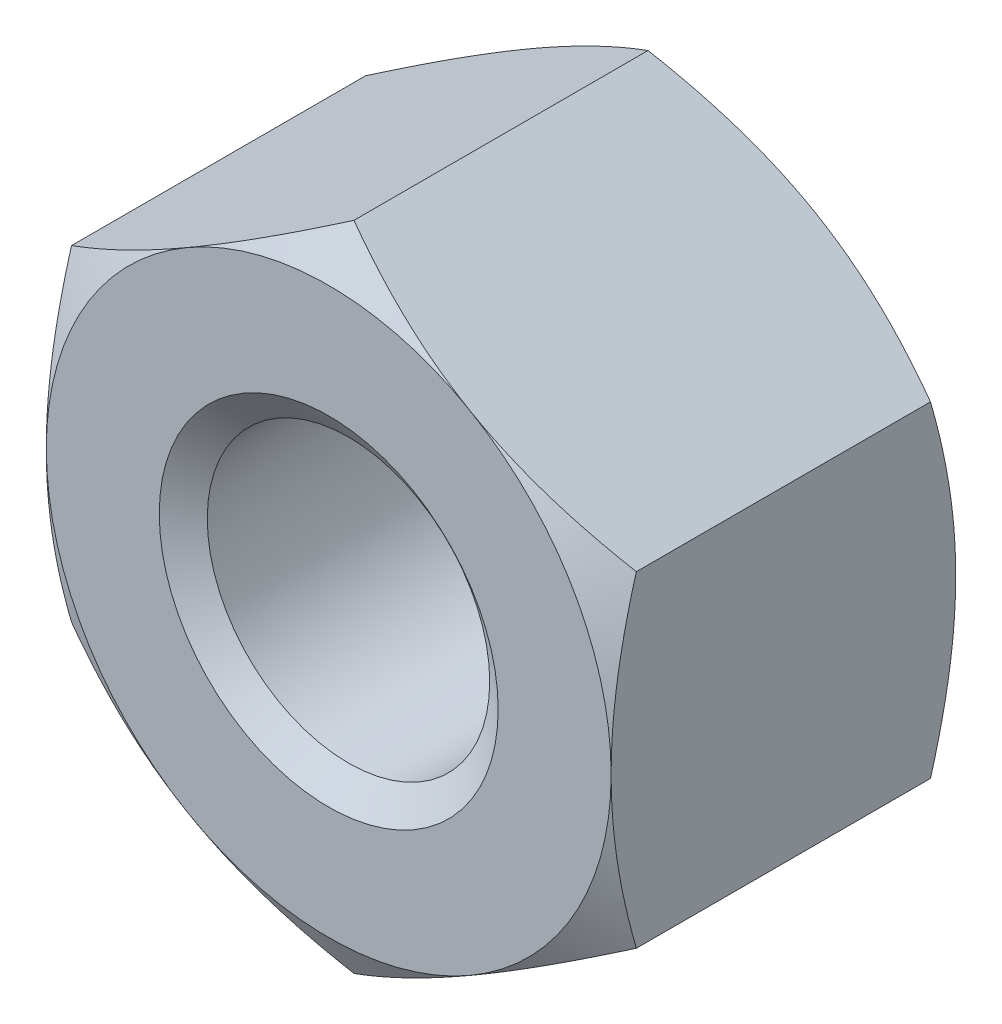
ISO-10303-21;
HEADER;
FILE_DESCRIPTION(('STEP AP214'),'2;1');
FILE_NAME('part.step','',(''),(''),'','','');
FILE_SCHEMA(('AUTOMOTIVE_DESIGN { 1 0 10303 214 1 1 1 1 }'));
ENDSEC;
DATA;
#1=APPLICATION_CONTEXT('core data for automotive mechanical design processes');
#2=APPLICATION_PROTOCOL_DEFINITION('international standard','automotive_design',2000,#1);
#3=PRODUCT_CONTEXT('',#1,'mechanical');
#4=PRODUCT('Part','Part','',(#3));
#5=PRODUCT_RELATED_PRODUCT_CATEGORY('part','',(#4));
#6=PRODUCT_DEFINITION_FORMATION('','',#4);
#7=PRODUCT_DEFINITION_CONTEXT('part definition',#1,'design');
#8=PRODUCT_DEFINITION('design','',#6,#7);
#9=PRODUCT_DEFINITION_SHAPE('','',#8);
#10=(LENGTH_UNIT() NAMED_UNIT(*) SI_UNIT(.MILLI.,.METRE.));
#11=(NAMED_UNIT(*) PLANE_ANGLE_UNIT() SI_UNIT($,.RADIAN.));
#12=(NAMED_UNIT(*) SI_UNIT($,.STERADIAN.) SOLID_ANGLE_UNIT());
#13=UNCERTAINTY_MEASURE_WITH_UNIT(LENGTH_MEASURE(1.E-05),#10,'distance_accuracy_value','');
#14=(GEOMETRIC_REPRESENTATION_CONTEXT(3) GLOBAL_UNCERTAINTY_ASSIGNED_CONTEXT((#13)) GLOBAL_UNIT_ASSIGNED_CONTEXT((#10,
#11,#12)) REPRESENTATION_CONTEXT('',''));
#15=CARTESIAN_POINT('',(0.,0.,0.));
#16=DIRECTION('',(0.,0.,1.));
#17=DIRECTION('',(1.,0.,0.));
#18=AXIS2_PLACEMENT_3D('',#15,#16,#17);
#19=CARTESIAN_POINT('',(0.,0.,-6.1));
#20=DIRECTION('',(0.,0.,1.));
#21=DIRECTION('',(1.,0.,0.));
#22=AXIS2_PLACEMENT_3D('',#19,#20,#21);
#23=CYLINDRICAL_SURFACE('',#22,2.5);
#24=CARTESIAN_POINT('',(0.,0.,-0.350103769104851));
#25=DIRECTION('',(0.,0.,1.));
#26=DIRECTION('',(1.,0.,0.));
#27=AXIS2_PLACEMENT_3D('',#24,#25,#26);
#28=CIRCLE('',#27,2.5);
#29=CARTESIAN_POINT('',(2.5,0.,-0.350103769104851));
#30=VERTEX_POINT('',#29);
#31=EDGE_CURVE('E175',#30,#30,#28,.F.);
#32=ORIENTED_EDGE('',*,*,#31,.F.);
#33=EDGE_LOOP('',(#32));
#34=FACE_BOUND('',#33,.T.);
#35=CARTESIAN_POINT('',(0.,0.,-5.72449623089514));
#36=DIRECTION('',(0.,0.,-1.));
#37=DIRECTION('',(-1.,0.,0.));
#38=AXIS2_PLACEMENT_3D('',#35,#36,#37);
#39=CIRCLE('',#38,2.5);
#40=CARTESIAN_POINT('',(-2.5,0.,-5.72449623089514));
#41=VERTEX_POINT('',#40);
#42=EDGE_CURVE('E40',#41,#41,#39,.F.);
#43=ORIENTED_EDGE('',*,*,#42,.F.);
#44=EDGE_LOOP('',(#43));
#45=FACE_BOUND('',#44,.T.);
#46=ADVANCED_FACE('F35',(#34,#45),#23,.F.);
#47=CARTESIAN_POINT('',(0.,5.77350269189627,-6.1));
#48=DIRECTION('',(-0.500000000000002,0.866025403784437,0.));
#49=DIRECTION('',(-0.866025403784438,-0.500000000000002,0.));
#50=AXIS2_PLACEMENT_3D('',#47,#48,#49);
#51=PLANE('',#50);
#52=DIRECTION('',(0.,0.,1.));
#53=VECTOR('',#52,1.);
#54=CARTESIAN_POINT('',(-5.,2.88675134594812,-6.1));
#55=LINE('',#54,#53);
#56=CARTESIAN_POINT('',(-5.,2.88675134594815,-5.65341801261478));
#57=VERTEX_POINT('',#56);
#58=CARTESIAN_POINT('',(-5.,2.88675134594812,-0.446581987385205));
#59=VERTEX_POINT('',#58);
#60=EDGE_CURVE('E165',#57,#59,#55,.T.);
#61=ORIENTED_EDGE('',*,*,#60,.T.);
#62=CARTESIAN_POINT('',(-5.0002,2.88663587589428,-0.446648656051831));
#63=CARTESIAN_POINT('',(-4.78046540547482,3.01349970319367,-0.373386567637637));
#64=CARTESIAN_POINT('',(-4.55885141554042,3.14144859993848,-0.306751321918093));
#65=CARTESIAN_POINT('',(-4.11178600454649,3.3995619353212,-0.19043899101081));
#66=CARTESIAN_POINT('',(-3.88632664040923,3.52973095989717,-0.140803049915788));
#67=CARTESIAN_POINT('',(-3.43816769477649,3.78847564779797,-0.0635510254186968));
#68=CARTESIAN_POINT('',(-3.21553790689581,3.91701101576052,-0.0354203782834884));
#69=CARTESIAN_POINT('',(-2.88081009815336,4.11026620624322,-0.0101949219536836));
#70=CARTESIAN_POINT('',(-2.76915780319494,4.17472868879311,-0.00461345976948308));
#71=CARTESIAN_POINT('',(-2.5457500293262,4.30371322717528,0.000797783248530206));
#72=CARTESIAN_POINT('',(-2.43399455370969,4.36823528110589,0.00062774174179659));
#73=CARTESIAN_POINT('',(-2.12781576914936,4.54500768479194,-0.00775363179203757));
#74=CARTESIAN_POINT('',(-1.93349391403279,4.65719946015293,-0.021829771897253));
#75=CARTESIAN_POINT('',(-1.54613989800229,4.88083840557982,-0.0664652571094334));
#76=CARTESIAN_POINT('',(-1.35310909862843,4.99228478956021,-0.0970398601475112));
#77=CARTESIAN_POINT('',(-0.964974657525142,5.21637431361295,-0.173468493621169));
#78=CARTESIAN_POINT('',(-0.76992000135826,5.32898917185759,-0.219646378878686));
#79=CARTESIAN_POINT('',(-0.382719654641226,5.55253939626499,-0.324451794491943));
#80=CARTESIAN_POINT('',(-0.190569004591907,5.66347762579593,-0.383054703437384));
#81=CARTESIAN_POINT('',(0.000200000000006643,5.77361816195011,-0.44664865605184));
#82=B_SPLINE_CURVE_WITH_KNOTS('',3,(#62,#63,#64,#65,#66,#67,#68,#69,#70,#71,#72,#73,#74,#75,#76,
#77,#78,#79,#80,#81),.UNSPECIFIED.,.F.,.F.,(4,2,2,2,2,2,2,2,2,4),(0.,0.792555841363092,
1.58701660053334,2.36181537487281,2.74884076077326,3.13585419177295,3.8096236259968,
4.4840172390119,5.1733688234893,5.86136694793727),.UNSPECIFIED.);
#83=CARTESIAN_POINT('',(-2.50000000000001,4.33012701892219,0.));
#84=VERTEX_POINT('',#83);
#85=EDGE_CURVE('E134',#59,#84,#82,.T.);
#86=ORIENTED_EDGE('',*,*,#85,.T.);
#87=CARTESIAN_POINT('',(0.,5.77350269189627,-0.446581987385213));
#88=VERTEX_POINT('',#87);
#89=EDGE_CURVE('E54',#84,#88,#82,.T.);
#90=ORIENTED_EDGE('',*,*,#89,.T.);
#91=DIRECTION('',(0.,0.,1.));
#92=VECTOR('',#91,1.);
#93=CARTESIAN_POINT('',(0.,5.77350269189627,-6.1));
#94=LINE('',#93,#92);
#95=CARTESIAN_POINT('',(0.,5.77350269189627,-5.65341801261478));
#96=VERTEX_POINT('',#95);
#97=EDGE_CURVE('E150',#96,#88,#94,.T.);
#98=ORIENTED_EDGE('',*,*,#97,.F.);
#99=CARTESIAN_POINT('',(-5.0002,2.88663587589428,-5.65335134394817));
#100=CARTESIAN_POINT('',(-4.78046540547482,3.01349970319367,-5.72661343236236));
#101=CARTESIAN_POINT('',(-4.55885141554042,3.14144859993848,-5.7932486780819));
#102=CARTESIAN_POINT('',(-4.11178600454649,3.3995619353212,-5.90956100898919));
#103=CARTESIAN_POINT('',(-3.88632664040923,3.52973095989717,-5.95919695008421));
#104=CARTESIAN_POINT('',(-3.43816769477649,3.78847564779797,-6.0364489745813));
#105=CARTESIAN_POINT('',(-3.21553790689581,3.91701101576052,-6.06457962171651));
#106=CARTESIAN_POINT('',(-2.88081009815336,4.11026620624322,-6.08980507804631));
#107=CARTESIAN_POINT('',(-2.76915780319494,4.17472868879311,-6.09538654023051));
#108=CARTESIAN_POINT('',(-2.5457500293262,4.30371322717528,-6.10079778324853));
#109=CARTESIAN_POINT('',(-2.43399455370969,4.36823528110589,-6.10062774174179));
#110=CARTESIAN_POINT('',(-2.12781576914936,4.54500768479194,-6.09224636820796));
#111=CARTESIAN_POINT('',(-1.93349391403279,4.65719946015293,-6.07817022810274));
#112=CARTESIAN_POINT('',(-1.54613989800229,4.88083840557982,-6.03353474289056));
#113=CARTESIAN_POINT('',(-1.35310909862843,4.99228478956021,-6.00296013985249));
#114=CARTESIAN_POINT('',(-0.964974657525142,5.21637431361295,-5.92653150637883));
#115=CARTESIAN_POINT('',(-0.76992000135826,5.32898917185759,-5.88035362112131));
#116=CARTESIAN_POINT('',(-0.382719654641226,5.55253939626499,-5.77554820550806));
#117=CARTESIAN_POINT('',(-0.190569004591907,5.66347762579593,-5.71694529656261));
#118=CARTESIAN_POINT('',(0.000200000000006649,5.77361816195011,-5.65335134394816));
#119=B_SPLINE_CURVE_WITH_KNOTS('',3,(#99,#100,#101,#102,#103,#104,#105,#106,#107,#108,#109,#110,
#111,#112,#113,#114,#115,#116,#117,#118),.UNSPECIFIED.,.F.,.F.,(4,2,2,2,2,2,2,2,2,4),(0.,
0.792555841363093,1.58701660053334,2.36181537487281,2.74884076077326,3.13585419177295,
3.8096236259968,4.4840172390119,5.1733688234893,5.86136694793727),.UNSPECIFIED.);
#120=CARTESIAN_POINT('',(-2.50000000000001,4.33012701892219,-6.1));
#121=VERTEX_POINT('',#120);
#122=EDGE_CURVE('E168',#121,#96,#119,.T.);
#123=ORIENTED_EDGE('',*,*,#122,.F.);
#124=EDGE_CURVE('E267',#57,#121,#119,.T.);
#125=ORIENTED_EDGE('',*,*,#124,.F.);
#126=EDGE_LOOP('',(#61,#86,#90,#98,#123,#125));
#127=FACE_BOUND('',#126,.T.);
#128=ADVANCED_FACE('F37',(#127),#51,.T.);
#129=CARTESIAN_POINT('',(5.,2.88675134594812,-6.1));
#130=DIRECTION('',(0.500000000000003,0.866025403784437,0.));
#131=DIRECTION('',(-0.866025403784437,0.500000000000003,0.));
#132=AXIS2_PLACEMENT_3D('',#129,#130,#131);
#133=PLANE('',#132);
#134=ORIENTED_EDGE('',*,*,#97,.T.);
#135=CARTESIAN_POINT('',(-0.000199999999993257,5.77361816195011,-0.44664865605184));
#136=CARTESIAN_POINT('',(0.219534594525191,5.64675433465072,-0.373386567637644));
#137=CARTESIAN_POINT('',(0.441148584459587,5.5188054379059,-0.3067513219181));
#138=CARTESIAN_POINT('',(0.888213995453521,5.26069210252318,-0.190438991010816));
#139=CARTESIAN_POINT('',(1.11367335959078,5.13052307794721,-0.140803049915793));
#140=CARTESIAN_POINT('',(1.56183230522352,4.87177839004641,-0.0635510254187007));
#141=CARTESIAN_POINT('',(1.7844620931042,4.74324302208387,-0.0354203782834916));
#142=CARTESIAN_POINT('',(2.11918990184665,4.54998783160116,-0.010194921953686));
#143=CARTESIAN_POINT('',(2.23084219680507,4.48552534905128,-0.00461345976948519));
#144=CARTESIAN_POINT('',(2.45424997067381,4.35654081066911,0.000797783248529064));
#145=CARTESIAN_POINT('',(2.56600544629032,4.2920187567385,0.000627741741796142));
#146=CARTESIAN_POINT('',(2.87218423085065,4.11524635305244,-0.00775363179203673));
#147=CARTESIAN_POINT('',(3.06650608596722,4.00305457769146,-0.0218297718972519));
#148=CARTESIAN_POINT('',(3.45386010199771,3.77941563226457,-0.0664652571094315));
#149=CARTESIAN_POINT('',(3.64689090137158,3.66796924828418,-0.0970398601475088));
#150=CARTESIAN_POINT('',(4.03502534247486,3.44387972423143,-0.173468493621165));
#151=CARTESIAN_POINT('',(4.23007999864174,3.33126486598679,-0.219646378878681));
#152=CARTESIAN_POINT('',(4.61728034535877,3.10771464157939,-0.324451794491936));
#153=CARTESIAN_POINT('',(4.80943099540809,2.99677641204846,-0.383054703437376));
#154=CARTESIAN_POINT('',(5.0002,2.88663587589428,-0.446648656051831));
#155=B_SPLINE_CURVE_WITH_KNOTS('',3,(#135,#136,#137,#138,#139,#140,#141,#142,#143,#144,#145,
#146,#147,#148,#149,#150,#151,#152,#153,#154),.UNSPECIFIED.,.F.,.F.,(4,2,2,2,2,2,2,2,2,4),(0.,
0.792555841363094,1.58701660053334,2.36181537487282,2.74884076077326,3.13585419177296,
3.8096236259968,4.4840172390119,5.1733688234893,5.86136694793726),.UNSPECIFIED.);
#156=CARTESIAN_POINT('',(2.50000000000002,4.33012701892218,0.));
#157=VERTEX_POINT('',#156);
#158=EDGE_CURVE('E144',#88,#157,#155,.T.);
#159=ORIENTED_EDGE('',*,*,#158,.T.);
#160=CARTESIAN_POINT('',(5.,2.88675134594814,-0.446581987385213));
#161=VERTEX_POINT('',#160);
#162=EDGE_CURVE('E61',#157,#161,#155,.T.);
#163=ORIENTED_EDGE('',*,*,#162,.T.);
#164=DIRECTION('',(0.,0.,1.));
#165=VECTOR('',#164,1.);
#166=CARTESIAN_POINT('',(5.,2.88675134594812,-6.1));
#167=LINE('',#166,#165);
#168=CARTESIAN_POINT('',(5.,2.88675134594814,-5.65341801261478));
#169=VERTEX_POINT('',#168);
#170=EDGE_CURVE('E143',#169,#161,#167,.T.);
#171=ORIENTED_EDGE('',*,*,#170,.F.);
#172=CARTESIAN_POINT('',(-0.000199999999993257,5.77361816195011,-5.65335134394816));
#173=CARTESIAN_POINT('',(0.219534594525192,5.64675433465072,-5.72661343236235));
#174=CARTESIAN_POINT('',(0.441148584459588,5.5188054379059,-5.7932486780819));
#175=CARTESIAN_POINT('',(0.888213995453521,5.26069210252318,-5.90956100898918));
#176=CARTESIAN_POINT('',(1.11367335959078,5.13052307794721,-5.9591969500842));
#177=CARTESIAN_POINT('',(1.56183230522352,4.87177839004641,-6.0364489745813));
#178=CARTESIAN_POINT('',(1.7844620931042,4.74324302208387,-6.06457962171651));
#179=CARTESIAN_POINT('',(2.11918990184665,4.54998783160116,-6.08980507804631));
#180=CARTESIAN_POINT('',(2.23084219680507,4.48552534905128,-6.09538654023051));
#181=CARTESIAN_POINT('',(2.45424997067381,4.35654081066911,-6.10079778324853));
#182=CARTESIAN_POINT('',(2.56600544629032,4.2920187567385,-6.10062774174179));
#183=CARTESIAN_POINT('',(2.87218423085065,4.11524635305244,-6.09224636820796));
#184=CARTESIAN_POINT('',(3.06650608596722,4.00305457769146,-6.07817022810275));
#185=CARTESIAN_POINT('',(3.45386010199771,3.77941563226457,-6.03353474289057));
#186=CARTESIAN_POINT('',(3.64689090137158,3.66796924828418,-6.00296013985249));
#187=CARTESIAN_POINT('',(4.03502534247486,3.44387972423143,-5.92653150637883));
#188=CARTESIAN_POINT('',(4.23007999864174,3.33126486598679,-5.88035362112132));
#189=CARTESIAN_POINT('',(4.61728034535877,3.10771464157939,-5.77554820550806));
#190=CARTESIAN_POINT('',(4.80943099540809,2.99677641204846,-5.71694529656262));
#191=CARTESIAN_POINT('',(5.0002,2.88663587589428,-5.65335134394817));
#192=B_SPLINE_CURVE_WITH_KNOTS('',3,(#172,#173,#174,#175,#176,#177,#178,#179,#180,#181,#182,
#183,#184,#185,#186,#187,#188,#189,#190,#191),.UNSPECIFIED.,.F.,.F.,(4,2,2,2,2,2,2,2,2,4),(0.,
0.792555841363094,1.58701660053334,2.36181537487281,2.74884076077326,3.13585419177296,
3.8096236259968,4.4840172390119,5.1733688234893,5.86136694793726),.UNSPECIFIED.);
#193=CARTESIAN_POINT('',(2.50000000000002,4.33012701892218,-6.1));
#194=VERTEX_POINT('',#193);
#195=EDGE_CURVE('E260',#194,#169,#192,.T.);
#196=ORIENTED_EDGE('',*,*,#195,.F.);
#197=EDGE_CURVE('E266',#96,#194,#192,.T.);
#198=ORIENTED_EDGE('',*,*,#197,.F.);
#199=EDGE_LOOP('',(#134,#159,#163,#171,#196,#198));
#200=FACE_BOUND('',#199,.T.);
#201=ADVANCED_FACE('F141',(#200),#133,.T.);
#202=CARTESIAN_POINT('',(5.,2.88675134594812,-6.1));
#203=DIRECTION('',(-1.,0.,0.));
#204=DIRECTION('',(0.,0.,1.));
#205=AXIS2_PLACEMENT_3D('',#202,#203,#204);
#206=PLANE('',#205);
#207=CARTESIAN_POINT('',(5.,-7.65608998744868,-2.39263352655083));
#208=CARTESIAN_POINT('',(5.,-7.43656171400169,-2.2865453381721));
#209=CARTESIAN_POINT('',(5.,-7.21651440170025,-2.18151175461598));
#210=CARTESIAN_POINT('',(5.,-6.77510105921521,-1.97415643363979));
#211=CARTESIAN_POINT('',(5.,-6.55373480873055,-1.87183516574571));
#212=CARTESIAN_POINT('',(5.,-6.1082071471036,-1.66996807853493));
#213=CARTESIAN_POINT('',(5.,-5.88403698971127,-1.57044149281733));
#214=CARTESIAN_POINT('',(5.,-5.4338541807468,-1.37566323278683));
#215=CARTESIAN_POINT('',(5.,-5.20784162594281,-1.28041133564245));
#216=CARTESIAN_POINT('',(5.,-4.75080884782759,-1.09418830918943));
#217=CARTESIAN_POINT('',(5.,-4.51976121099508,-1.00328409099872));
#218=CARTESIAN_POINT('',(5.,-4.05494053422102,-0.828595302971964));
#219=CARTESIAN_POINT('',(5.,-3.82116719434027,-0.744811525247666));
#220=CARTESIAN_POINT('',(5.,-3.35100416711891,-0.586614632364632));
#221=CARTESIAN_POINT('',(5.,-3.1146212508819,-0.512181595225283));
#222=CARTESIAN_POINT('',(5.,-2.63849247870026,-0.375104393872387));
#223=CARTESIAN_POINT('',(5.,-2.39874771210332,-0.312456501596959));
#224=CARTESIAN_POINT('',(5.,-1.91574303714499,-0.201987753994876));
#225=CARTESIAN_POINT('',(5.,-1.67248221084102,-0.154170846558648));
#226=CARTESIAN_POINT('',(5.,-1.18299359688666,-0.0765955557924074));
#227=CARTESIAN_POINT('',(5.,-0.936765806613298,-0.0468371884284136));
#228=CARTESIAN_POINT('',(5.,-0.567032279323863,-0.0176512015863002));
#229=CARTESIAN_POINT('',(5.,-0.444105297658555,-0.0104963190599506));
#230=CARTESIAN_POINT('',(5.,-0.19805300523858,-0.00139545226904392));
#231=CARTESIAN_POINT('',(5.,-0.0749276970802428,0.000550599639611712));
#232=CARTESIAN_POINT('',(5.,0.17125799989234,-0.000818470345666107));
#233=CARTESIAN_POINT('',(5.,0.294318397227076,-0.00413211431301328));
#234=CARTESIAN_POINT('',(5.,0.540192730788829,-0.0159365972827615));
#235=CARTESIAN_POINT('',(5.,0.663006654263472,-0.0244276975701667));
#236=CARTESIAN_POINT('',(5.,0.960681872881655,-0.0511063802753025));
#237=CARTESIAN_POINT('',(5.,1.13531436279939,-0.0718889676982873));
#238=CARTESIAN_POINT('',(5.,1.48321675799387,-0.122765655722695));
#239=CARTESIAN_POINT('',(5.,1.65648647841235,-0.152860997990034));
#240=CARTESIAN_POINT('',(5.,2.00155426058697,-0.221298792011551));
#241=CARTESIAN_POINT('',(5.,2.17335067370371,-0.259649477486403));
#242=CARTESIAN_POINT('',(5.,2.51518168221052,-0.343428305385009));
#243=CARTESIAN_POINT('',(5.,2.68521638419308,-0.388856016913999));
#244=CARTESIAN_POINT('',(5.,3.02770318928889,-0.486887782054289));
#245=CARTESIAN_POINT('',(5.,3.20011248435309,-0.539640363823938));
#246=CARTESIAN_POINT('',(5.,3.54310870430174,-0.650357787302621));
#247=CARTESIAN_POINT('',(5.,3.71369679659712,-0.708319033907065));
#248=CARTESIAN_POINT('',(5.,4.05236610267971,-0.828256540728468));
#249=CARTESIAN_POINT('',(5.,4.22045602230053,-0.890208365426358));
#250=CARTESIAN_POINT('',(5.,4.55533171687445,-1.01774823413811));
#251=CARTESIAN_POINT('',(5.,4.72211693321411,-1.08333774778776));
#252=CARTESIAN_POINT('',(5.,4.88829623733352,-1.15038625817723));
#253=B_SPLINE_CURVE_WITH_KNOTS('',3,(#207,#208,#209,#210,#211,#212,#213,#214,#215,#216,#217,
#218,#219,#220,#221,#222,#223,#224,#225,#226,#227,#228,#229,#230,#231,#232,#233,#234,#235,#236,
#237,#238,#239,#240,#241,#242,#243,#244,#245,#246,#247,#248,#249,#250,#251,#252),.UNSPECIFIED.,
.F.,.F.,(4,2,2,2,2,2,2,2,2,2,2,2,2,2,2,2,2,2,2,2,2,2,4),(0.,0.731464740665353,1.46305528824909,
2.19883243307487,2.93457117856034,3.67934251246859,4.42419659013362,5.16743580871991,
5.9104395173934,6.65364083834808,7.39684281638518,7.76615414335458,8.13546067426613,
8.50466345177858,8.87388486298455,9.40118542949729,9.92855633110017,10.4564556797854,
10.9843228991235,11.525120280828,12.065547221064,12.6029322754131,13.1405360390026),.UNSPECIFIED.);
#254=CARTESIAN_POINT('',(4.99999999999999,-2.88675134594816,-0.446581987385213));
#255=VERTEX_POINT('',#254);
#256=CARTESIAN_POINT('',(5.,0.,0.));
#257=VERTEX_POINT('',#256);
#258=EDGE_CURVE('E136',#255,#257,#253,.T.);
#259=ORIENTED_EDGE('',*,*,#258,.F.);
#260=DIRECTION('',(0.,0.,1.));
#261=VECTOR('',#260,1.);
#262=CARTESIAN_POINT('',(5.,-2.88675134594816,-6.1));
#263=LINE('',#262,#261);
#264=CARTESIAN_POINT('',(4.99999999999999,-2.88675134594816,-5.65341801261478));
#265=VERTEX_POINT('',#264);
#266=EDGE_CURVE('E151',#265,#255,#263,.T.);
#267=ORIENTED_EDGE('',*,*,#266,.F.);
#268=CARTESIAN_POINT('',(5.,-7.65608998744868,-3.70736647344917));
#269=CARTESIAN_POINT('',(5.,-7.43656171400169,-3.8134546618279));
#270=CARTESIAN_POINT('',(5.,-7.21651440170025,-3.91848824538402));
#271=CARTESIAN_POINT('',(5.,-6.77510105921521,-4.12584356636021));
#272=CARTESIAN_POINT('',(5.,-6.55373480873055,-4.22816483425429));
#273=CARTESIAN_POINT('',(5.,-6.1082071471036,-4.43003192146507));
#274=CARTESIAN_POINT('',(5.,-5.88403698971127,-4.52955850718267));
#275=CARTESIAN_POINT('',(5.,-5.4338541807468,-4.72433676721316));
#276=CARTESIAN_POINT('',(5.,-5.20784162594281,-4.81958866435755));
#277=CARTESIAN_POINT('',(5.,-4.75080884782759,-5.00581169081057));
#278=CARTESIAN_POINT('',(5.,-4.51976121099508,-5.09671590900128));
#279=CARTESIAN_POINT('',(5.,-4.05494053422102,-5.27140469702803));
#280=CARTESIAN_POINT('',(5.,-3.82116719434027,-5.35518847475233));
#281=CARTESIAN_POINT('',(5.,-3.35100416711891,-5.51338536763537));
#282=CARTESIAN_POINT('',(5.,-3.1146212508819,-5.58781840477472));
#283=CARTESIAN_POINT('',(5.,-2.63849247870026,-5.72489560612761));
#284=CARTESIAN_POINT('',(5.,-2.39874771210332,-5.78754349840304));
#285=CARTESIAN_POINT('',(5.,-1.91574303714499,-5.89801224600512));
#286=CARTESIAN_POINT('',(5.,-1.67248221084102,-5.94582915344135));
#287=CARTESIAN_POINT('',(5.,-1.18299359688666,-6.02340444420759));
#288=CARTESIAN_POINT('',(5.,-0.936765806613298,-6.05316281157158));
#289=CARTESIAN_POINT('',(5.,-0.567032279323863,-6.0823487984137));
#290=CARTESIAN_POINT('',(5.,-0.444105297658555,-6.08950368094005));
#291=CARTESIAN_POINT('',(5.,-0.19805300523858,-6.09860454773095));
#292=CARTESIAN_POINT('',(5.,-0.0749276970802429,-6.10055059963961));
#293=CARTESIAN_POINT('',(5.,0.17125799989234,-6.09918152965433));
#294=CARTESIAN_POINT('',(5.,0.294318397227076,-6.09586788568699));
#295=CARTESIAN_POINT('',(5.,0.540192730788829,-6.08406340271724));
#296=CARTESIAN_POINT('',(5.,0.663006654263472,-6.07557230242983));
#297=CARTESIAN_POINT('',(5.,0.960681872881655,-6.0488936197247));
#298=CARTESIAN_POINT('',(5.,1.13531436279938,-6.02811103230171));
#299=CARTESIAN_POINT('',(5.,1.48321675799387,-5.9772343442773));
#300=CARTESIAN_POINT('',(5.,1.65648647841235,-5.94713900200996));
#301=CARTESIAN_POINT('',(5.,2.00155426058697,-5.87870120798845));
#302=CARTESIAN_POINT('',(5.,2.17335067370371,-5.84035052251359));
#303=CARTESIAN_POINT('',(5.,2.51518168221052,-5.75657169461499));
#304=CARTESIAN_POINT('',(5.,2.68521638419308,-5.711143983086));
#305=CARTESIAN_POINT('',(5.,3.0277031892889,-5.61311221794571));
#306=CARTESIAN_POINT('',(5.,3.20011248435309,-5.56035963617606));
#307=CARTESIAN_POINT('',(5.,3.54310870430174,-5.44964221269738));
#308=CARTESIAN_POINT('',(5.,3.71369679659712,-5.39168096609293));
#309=CARTESIAN_POINT('',(5.,4.05236610267971,-5.27174345927153));
#310=CARTESIAN_POINT('',(5.,4.22045602230053,-5.20979163457364));
#311=CARTESIAN_POINT('',(5.,4.55533171687445,-5.08225176586188));
#312=CARTESIAN_POINT('',(5.,4.72211693321411,-5.01666225221223));
#313=CARTESIAN_POINT('',(5.,4.88829623733352,-4.94961374182276));
#314=B_SPLINE_CURVE_WITH_KNOTS('',3,(#268,#269,#270,#271,#272,#273,#274,#275,#276,#277,#278,
#279,#280,#281,#282,#283,#284,#285,#286,#287,#288,#289,#290,#291,#292,#293,#294,#295,#296,#297,
#298,#299,#300,#301,#302,#303,#304,#305,#306,#307,#308,#309,#310,#311,#312,#313),.UNSPECIFIED.,
.F.,.F.,(4,2,2,2,2,2,2,2,2,2,2,2,2,2,2,2,2,2,2,2,2,2,4),(0.,0.731464740665353,1.46305528824909,
2.19883243307487,2.93457117856034,3.67934251246859,4.42419659013362,5.16743580871991,
5.9104395173934,6.65364083834808,7.39684281638518,7.76615414335459,8.13546067426613,
8.50466345177858,8.87388486298455,9.40118542949729,9.92855633110017,10.4564556797854,
10.9843228991235,11.525120280828,12.065547221064,12.6029322754131,13.1405360390026),.UNSPECIFIED.);
#315=CARTESIAN_POINT('',(5.,0.,-6.1));
#316=VERTEX_POINT('',#315);
#317=EDGE_CURVE('E274',#265,#316,#314,.T.);
#318=ORIENTED_EDGE('',*,*,#317,.T.);
#319=EDGE_CURVE('E149',#316,#169,#314,.T.);
#320=ORIENTED_EDGE('',*,*,#319,.T.);
#321=ORIENTED_EDGE('',*,*,#170,.T.);
#322=EDGE_CURVE('E126',#257,#161,#253,.T.);
#323=ORIENTED_EDGE('',*,*,#322,.F.);
#324=EDGE_LOOP('',(#259,#267,#318,#320,#321,#323));
#325=FACE_BOUND('',#324,.T.);
#326=ADVANCED_FACE('F147',(#325),#206,.F.);
#327=CARTESIAN_POINT('',(0.,-5.7735026918963,-6.1));
#328=DIRECTION('',(0.500000000000002,-0.866025403784438,0.));
#329=DIRECTION('',(0.866025403784438,0.500000000000002,0.));
#330=AXIS2_PLACEMENT_3D('',#327,#328,#329);
#331=PLANE('',#330);
#332=ORIENTED_EDGE('',*,*,#266,.T.);
#333=CARTESIAN_POINT('',(5.0002,-2.88663587589432,-0.446648656051843));
#334=CARTESIAN_POINT('',(4.78046540547482,-3.01349970319371,-0.373386567637648));
#335=CARTESIAN_POINT('',(4.55885141554042,-3.14144859993852,-0.306751321918105));
#336=CARTESIAN_POINT('',(4.11178600454649,-3.39956193532124,-0.190438991010824));
#337=CARTESIAN_POINT('',(3.88632664040923,-3.52973095989721,-0.140803049915803));
#338=CARTESIAN_POINT('',(3.43816769477649,-3.78847564779801,-0.0635510254187122));
#339=CARTESIAN_POINT('',(3.2155379068958,-3.91701101576055,-0.035420378283504));
#340=CARTESIAN_POINT('',(2.88081009815335,-4.11026620624326,-0.0101949219537004));
#341=CARTESIAN_POINT('',(2.76915780319493,-4.17472868879315,-0.00461345976950035));
#342=CARTESIAN_POINT('',(2.5457500293262,-4.30371322717532,0.000797783248512415));
#343=CARTESIAN_POINT('',(2.43399455370968,-4.36823528110593,0.000627741741778789));
#344=CARTESIAN_POINT('',(2.12781576914935,-4.54500768479198,-0.00775363179205593));
#345=CARTESIAN_POINT('',(1.93349391403278,-4.65719946015297,-0.0218297718972722));
#346=CARTESIAN_POINT('',(1.54613989800229,-4.88083840557985,-0.0664652571094536));
#347=CARTESIAN_POINT('',(1.35310909862842,-4.99228478956024,-0.0970398601475317));
#348=CARTESIAN_POINT('',(0.964974657525142,-5.21637431361299,-0.173468493621189));
#349=CARTESIAN_POINT('',(0.769920001358261,-5.32898917185763,-0.219646378878706));
#350=CARTESIAN_POINT('',(0.38271965464123,-5.55253939626502,-0.324451794491962));
#351=CARTESIAN_POINT('',(0.190569004591912,-5.66347762579596,-0.383054703437403));
#352=CARTESIAN_POINT('',(-0.000200000000000318,-5.77361816195014,-0.446648656051858));
#353=B_SPLINE_CURVE_WITH_KNOTS('',3,(#333,#334,#335,#336,#337,#338,#339,#340,#341,#342,#343,
#344,#345,#346,#347,#348,#349,#350,#351,#352),.UNSPECIFIED.,.F.,.F.,(4,2,2,2,2,2,2,2,2,4),(0.,
0.792555841363094,1.58701660053334,2.36181537487282,2.74884076077327,3.13585419177297,
3.80962362599681,4.48401723901191,5.1733688234893,5.86136694793726),.UNSPECIFIED.);
#354=CARTESIAN_POINT('',(2.50000000000001,-4.33012701892219,0.));
#355=VERTEX_POINT('',#354);
#356=EDGE_CURVE('E372',#255,#355,#353,.T.);
#357=ORIENTED_EDGE('',*,*,#356,.T.);
#358=CARTESIAN_POINT('',(0.,-5.77350269189627,-0.446581987385213));
#359=VERTEX_POINT('',#358);
#360=EDGE_CURVE('E228',#355,#359,#353,.T.);
#361=ORIENTED_EDGE('',*,*,#360,.T.);
#362=DIRECTION('',(0.,0.,1.));
#363=VECTOR('',#362,1.);
#364=CARTESIAN_POINT('',(0.,-5.7735026918963,-6.1));
#365=LINE('',#364,#363);
#366=CARTESIAN_POINT('',(0.,-5.77350269189627,-5.65341801261478));
#367=VERTEX_POINT('',#366);
#368=EDGE_CURVE('E156',#367,#359,#365,.T.);
#369=ORIENTED_EDGE('',*,*,#368,.F.);
#370=CARTESIAN_POINT('',(5.0002,-2.88663587589432,-5.65335134394816));
#371=CARTESIAN_POINT('',(4.78046540547482,-3.01349970319371,-5.72661343236235));
#372=CARTESIAN_POINT('',(4.55885141554042,-3.14144859993852,-5.79324867808189));
#373=CARTESIAN_POINT('',(4.11178600454649,-3.39956193532124,-5.90956100898917));
#374=CARTESIAN_POINT('',(3.88632664040923,-3.52973095989721,-5.9591969500842));
#375=CARTESIAN_POINT('',(3.43816769477649,-3.78847564779801,-6.03644897458129));
#376=CARTESIAN_POINT('',(3.2155379068958,-3.91701101576055,-6.06457962171649));
#377=CARTESIAN_POINT('',(2.88081009815335,-4.11026620624326,-6.0898050780463));
#378=CARTESIAN_POINT('',(2.76915780319493,-4.17472868879315,-6.0953865402305));
#379=CARTESIAN_POINT('',(2.5457500293262,-4.30371322717532,-6.10079778324851));
#380=CARTESIAN_POINT('',(2.43399455370968,-4.36823528110593,-6.10062774174178));
#381=CARTESIAN_POINT('',(2.12781576914935,-4.54500768479198,-6.09224636820794));
#382=CARTESIAN_POINT('',(1.93349391403278,-4.65719946015297,-6.07817022810273));
#383=CARTESIAN_POINT('',(1.54613989800229,-4.88083840557985,-6.03353474289054));
#384=CARTESIAN_POINT('',(1.35310909862842,-4.99228478956024,-6.00296013985247));
#385=CARTESIAN_POINT('',(0.964974657525142,-5.21637431361299,-5.92653150637881));
#386=CARTESIAN_POINT('',(0.769920001358261,-5.32898917185763,-5.88035362112129));
#387=CARTESIAN_POINT('',(0.38271965464123,-5.55253939626502,-5.77554820550804));
#388=CARTESIAN_POINT('',(0.190569004591913,-5.66347762579596,-5.71694529656259));
#389=CARTESIAN_POINT('',(-0.000200000000000308,-5.77361816195014,-5.65335134394814));
#390=B_SPLINE_CURVE_WITH_KNOTS('',3,(#370,#371,#372,#373,#374,#375,#376,#377,#378,#379,#380,
#381,#382,#383,#384,#385,#386,#387,#388,#389),.UNSPECIFIED.,.F.,.F.,(4,2,2,2,2,2,2,2,2,4),(0.,
0.792555841363095,1.58701660053334,2.36181537487282,2.74884076077327,3.13585419177296,
3.80962362599681,4.48401723901191,5.1733688234893,5.86136694793726),.UNSPECIFIED.);
#391=CARTESIAN_POINT('',(2.50000000000001,-4.33012701892219,-6.1));
#392=VERTEX_POINT('',#391);
#393=EDGE_CURVE('E281',#392,#367,#390,.T.);
#394=ORIENTED_EDGE('',*,*,#393,.F.);
#395=EDGE_CURVE('E280',#265,#392,#390,.T.);
#396=ORIENTED_EDGE('',*,*,#395,.F.);
#397=EDGE_LOOP('',(#332,#357,#361,#369,#394,#396));
#398=FACE_BOUND('',#397,.T.);
#399=ADVANCED_FACE('F293',(#398),#331,.T.);
#400=CARTESIAN_POINT('',(-5.,-2.88675134594815,-6.1));
#401=DIRECTION('',(-0.500000000000003,-0.866025403784437,0.));
#402=DIRECTION('',(0.866025403784437,-0.500000000000003,0.));
#403=AXIS2_PLACEMENT_3D('',#400,#401,#402);
#404=PLANE('',#403);
#405=ORIENTED_EDGE('',*,*,#368,.T.);
#406=CARTESIAN_POINT('',(0.000199999999999732,-5.77361816195014,-0.446648656051858));
#407=CARTESIAN_POINT('',(-0.219534594525186,-5.64675433465075,-0.373386567637661));
#408=CARTESIAN_POINT('',(-0.441148584459583,-5.51880543790594,-0.306751321918117));
#409=CARTESIAN_POINT('',(-0.888213995453519,-5.26069210252321,-0.190438991010833));
#410=CARTESIAN_POINT('',(-1.11367335959078,-5.13052307794724,-0.14080304991581));
#411=CARTESIAN_POINT('',(-1.56183230522352,-4.87177839004644,-0.0635510254187167));
#412=CARTESIAN_POINT('',(-1.7844620931042,-4.7432430220839,-0.0354203782835069));
#413=CARTESIAN_POINT('',(-2.11918990184666,-4.54998783160119,-0.0101949219537006));
#414=CARTESIAN_POINT('',(-2.23084219680508,-4.4855253490513,-0.00461345976949976));
#415=CARTESIAN_POINT('',(-2.45424997067381,-4.35654081066913,0.000797783248514326));
#416=CARTESIAN_POINT('',(-2.56600544629033,-4.29201875673852,0.000627741741781144));
#417=CARTESIAN_POINT('',(-2.87218423085065,-4.11524635305246,-0.00775363179205176));
#418=CARTESIAN_POINT('',(-3.06650608596723,-4.00305457769148,-0.0218297718972661));
#419=CARTESIAN_POINT('',(-3.45386010199772,-3.77941563226459,-0.0664652571094445));
#420=CARTESIAN_POINT('',(-3.64689090137158,-3.66796924828421,-0.0970398601475216));
#421=CARTESIAN_POINT('',(-4.03502534247486,-3.44387972423146,-0.173468493621177));
#422=CARTESIAN_POINT('',(-4.23007999864174,-3.33126486598682,-0.219646378878693));
#423=CARTESIAN_POINT('',(-4.61728034535877,-3.10771464157942,-0.324451794491945));
#424=CARTESIAN_POINT('',(-4.80943099540809,-2.99677641204849,-0.383054703437385));
#425=CARTESIAN_POINT('',(-5.0002,-2.88663587589431,-0.446648656051839));
#426=B_SPLINE_CURVE_WITH_KNOTS('',3,(#406,#407,#408,#409,#410,#411,#412,#413,#414,#415,#416,
#417,#418,#419,#420,#421,#422,#423,#424,#425),.UNSPECIFIED.,.F.,.F.,(4,2,2,2,2,2,2,2,2,4),(0.,
0.792555841363097,1.58701660053335,2.36181537487283,2.74884076077328,3.13585419177298,
3.80962362599682,4.48401723901191,5.1733688234893,5.86136694793726),.UNSPECIFIED.);
#427=CARTESIAN_POINT('',(-2.50000000000001,-4.33012701892219,0.));
#428=VERTEX_POINT('',#427);
#429=EDGE_CURVE('E369',#359,#428,#426,.T.);
#430=ORIENTED_EDGE('',*,*,#429,.T.);
#431=CARTESIAN_POINT('',(-5.,-2.88675134594815,-0.446581987385213));
#432=VERTEX_POINT('',#431);
#433=EDGE_CURVE('E201',#428,#432,#426,.T.);
#434=ORIENTED_EDGE('',*,*,#433,.T.);
#435=DIRECTION('',(0.,0.,1.));
#436=VECTOR('',#435,1.);
#437=CARTESIAN_POINT('',(-5.,-2.88675134594815,-6.1));
#438=LINE('',#437,#436);
#439=CARTESIAN_POINT('',(-5.,-2.88675134594815,-5.65341801261478));
#440=VERTEX_POINT('',#439);
#441=EDGE_CURVE('E162',#440,#432,#438,.T.);
#442=ORIENTED_EDGE('',*,*,#441,.F.);
#443=CARTESIAN_POINT('',(0.000199999999999732,-5.77361816195014,-5.65335134394814));
#444=CARTESIAN_POINT('',(-0.219534594525186,-5.64675433465075,-5.72661343236234));
#445=CARTESIAN_POINT('',(-0.441148584459583,-5.51880543790594,-5.79324867808188));
#446=CARTESIAN_POINT('',(-0.888213995453519,-5.26069210252321,-5.90956100898916));
#447=CARTESIAN_POINT('',(-1.11367335959078,-5.13052307794724,-5.95919695008419));
#448=CARTESIAN_POINT('',(-1.56183230522352,-4.87177839004644,-6.03644897458128));
#449=CARTESIAN_POINT('',(-1.7844620931042,-4.7432430220839,-6.06457962171649));
#450=CARTESIAN_POINT('',(-2.11918990184666,-4.54998783160119,-6.0898050780463));
#451=CARTESIAN_POINT('',(-2.23084219680508,-4.4855253490513,-6.0953865402305));
#452=CARTESIAN_POINT('',(-2.45424997067381,-4.35654081066913,-6.10079778324851));
#453=CARTESIAN_POINT('',(-2.56600544629033,-4.29201875673852,-6.10062774174178));
#454=CARTESIAN_POINT('',(-2.87218423085066,-4.11524635305246,-6.09224636820795));
#455=CARTESIAN_POINT('',(-3.06650608596723,-4.00305457769148,-6.07817022810273));
#456=CARTESIAN_POINT('',(-3.45386010199772,-3.77941563226459,-6.03353474289055));
#457=CARTESIAN_POINT('',(-3.64689090137158,-3.6679692482842,-6.00296013985248));
#458=CARTESIAN_POINT('',(-4.03502534247486,-3.44387972423146,-5.92653150637882));
#459=CARTESIAN_POINT('',(-4.23007999864174,-3.33126486598682,-5.8803536211213));
#460=CARTESIAN_POINT('',(-4.61728034535877,-3.10771464157942,-5.77554820550805));
#461=CARTESIAN_POINT('',(-4.80943099540809,-2.99677641204849,-5.71694529656261));
#462=CARTESIAN_POINT('',(-5.0002,-2.88663587589431,-5.65335134394816));
#463=B_SPLINE_CURVE_WITH_KNOTS('',3,(#443,#444,#445,#446,#447,#448,#449,#450,#451,#452,#453,
#454,#455,#456,#457,#458,#459,#460,#461,#462),.UNSPECIFIED.,.F.,.F.,(4,2,2,2,2,2,2,2,2,4),(0.,
0.792555841363097,1.58701660053335,2.36181537487283,2.74884076077328,3.13585419177298,
3.80962362599682,4.48401723901191,5.1733688234893,5.86136694793726),.UNSPECIFIED.);
#464=CARTESIAN_POINT('',(-2.50000000000001,-4.33012701892219,-6.1));
#465=VERTEX_POINT('',#464);
#466=EDGE_CURVE('E288',#465,#440,#463,.T.);
#467=ORIENTED_EDGE('',*,*,#466,.F.);
#468=EDGE_CURVE('E287',#367,#465,#463,.T.);
#469=ORIENTED_EDGE('',*,*,#468,.F.);
#470=EDGE_LOOP('',(#405,#430,#434,#442,#467,#469));
#471=FACE_BOUND('',#470,.T.);
#472=ADVANCED_FACE('F296',(#471),#404,.T.);
#473=CARTESIAN_POINT('',(-5.,2.88675134594812,-6.1));
#474=DIRECTION('',(-1.,0.,0.));
#475=DIRECTION('',(0.,0.,1.));
#476=AXIS2_PLACEMENT_3D('',#473,#474,#475);
#477=PLANE('',#476);
#478=ORIENTED_EDGE('',*,*,#441,.T.);
#479=CARTESIAN_POINT('',(-5.,-7.65608998744867,-2.39263352655082));
#480=CARTESIAN_POINT('',(-5.,-7.43656171400168,-2.28654533817209));
#481=CARTESIAN_POINT('',(-5.,-7.21651440170023,-2.18151175461598));
#482=CARTESIAN_POINT('',(-5.,-6.7751010592152,-1.97415643363978));
#483=CARTESIAN_POINT('',(-5.,-6.55373480873054,-1.8718351657457));
#484=CARTESIAN_POINT('',(-5.,-6.10820714710358,-1.66996807853492));
#485=CARTESIAN_POINT('',(-5.,-5.88403698971126,-1.57044149281732));
#486=CARTESIAN_POINT('',(-5.,-5.43385418074679,-1.37566323278683));
#487=CARTESIAN_POINT('',(-5.,-5.2078416259428,-1.28041133564244));
#488=CARTESIAN_POINT('',(-5.,-4.75080884782757,-1.09418830918942));
#489=CARTESIAN_POINT('',(-5.,-4.51976121099506,-1.00328409099871));
#490=CARTESIAN_POINT('',(-5.,-4.05494053422101,-0.828595302971959));
#491=CARTESIAN_POINT('',(-5.,-3.82116719434026,-0.744811525247661));
#492=CARTESIAN_POINT('',(-5.,-3.3510041671189,-0.586614632364627));
#493=CARTESIAN_POINT('',(-5.,-3.11462125088189,-0.512181595225278));
#494=CARTESIAN_POINT('',(-5.,-2.63849247870025,-0.375104393872383));
#495=CARTESIAN_POINT('',(-5.,-2.39874771210332,-0.312456501596955));
#496=CARTESIAN_POINT('',(-5.,-1.91574303714498,-0.201987753994873));
#497=CARTESIAN_POINT('',(-5.,-1.67248221084101,-0.154170846558645));
#498=CARTESIAN_POINT('',(-5.,-1.18299359688665,-0.0765955557924046));
#499=CARTESIAN_POINT('',(-5.,-0.936765806613292,-0.0468371884284111));
#500=CARTESIAN_POINT('',(-5.,-0.567032279323858,-0.0176512015862977));
#501=CARTESIAN_POINT('',(-5.,-0.44410529765855,-0.010496319059948));
#502=CARTESIAN_POINT('',(-5.,-0.198053005238575,-0.00139545226904149));
#503=CARTESIAN_POINT('',(-5.,-0.0749276970802379,0.00055059963961394));
#504=CARTESIAN_POINT('',(-5.,0.171257999892344,-0.000818470345664327));
#505=CARTESIAN_POINT('',(-5.,0.29431839722708,-0.00413211431301173));
#506=CARTESIAN_POINT('',(-5.,0.540192730788833,-0.0159365972827601));
#507=CARTESIAN_POINT('',(-5.,0.663006654263476,-0.0244276975701653));
#508=CARTESIAN_POINT('',(-5.,0.960681872881659,-0.0511063802753009));
#509=CARTESIAN_POINT('',(-5.,1.13531436279939,-0.0718889676982857));
#510=CARTESIAN_POINT('',(-5.,1.48321675799388,-0.122765655722694));
#511=CARTESIAN_POINT('',(-5.,1.65648647841235,-0.152860997990033));
#512=CARTESIAN_POINT('',(-5.,2.00155426058698,-0.22129879201155));
#513=CARTESIAN_POINT('',(-5.,2.17335067370372,-0.259649477486403));
#514=CARTESIAN_POINT('',(-5.,2.51518168221052,-0.343428305385009));
#515=CARTESIAN_POINT('',(-5.,2.68521638419309,-0.388856016913999));
#516=CARTESIAN_POINT('',(-5.,3.0277031892889,-0.486887782054289));
#517=CARTESIAN_POINT('',(-5.,3.2001124843531,-0.539640363823938));
#518=CARTESIAN_POINT('',(-5.,3.54310870430174,-0.650357787302621));
#519=CARTESIAN_POINT('',(-5.,3.71369679659712,-0.708319033907065));
#520=CARTESIAN_POINT('',(-5.,4.05236610267971,-0.828256540728468));
#521=CARTESIAN_POINT('',(-5.,4.22045602230053,-0.890208365426359));
#522=CARTESIAN_POINT('',(-5.,4.55533171687445,-1.01774823413811));
#523=CARTESIAN_POINT('',(-5.,4.72211693321412,-1.08333774778776));
#524=CARTESIAN_POINT('',(-5.,4.88829623733352,-1.15038625817723));
#525=B_SPLINE_CURVE_WITH_KNOTS('',3,(#479,#480,#481,#482,#483,#484,#485,#486,#487,#488,#489,
#490,#491,#492,#493,#494,#495,#496,#497,#498,#499,#500,#501,#502,#503,#504,#505,#506,#507,#508,
#509,#510,#511,#512,#513,#514,#515,#516,#517,#518,#519,#520,#521,#522,#523,#524),.UNSPECIFIED.,
.F.,.F.,(4,2,2,2,2,2,2,2,2,2,2,2,2,2,2,2,2,2,2,2,2,2,4),(0.,0.731464740665354,1.46305528824909,
2.19883243307487,2.93457117856034,3.67934251246859,4.42419659013362,5.1674358087199,
5.9104395173934,6.65364083834807,7.39684281638517,7.76615414335458,8.13546067426612,
8.50466345177858,8.87388486298454,9.40118542949729,9.92855633110016,10.4564556797854,
10.9843228991235,11.525120280828,12.065547221064,12.6029322754131,13.1405360390026),.UNSPECIFIED.);
#526=CARTESIAN_POINT('',(-5.,0.,0.));
#527=VERTEX_POINT('',#526);
#528=EDGE_CURVE('E200',#432,#527,#525,.T.);
#529=ORIENTED_EDGE('',*,*,#528,.T.);
#530=EDGE_CURVE('E192',#527,#59,#525,.T.);
#531=ORIENTED_EDGE('',*,*,#530,.T.);
#532=ORIENTED_EDGE('',*,*,#60,.F.);
#533=CARTESIAN_POINT('',(-5.,-7.65608998744867,-3.70736647344918));
#534=CARTESIAN_POINT('',(-5.,-7.43656171400168,-3.81345466182791));
#535=CARTESIAN_POINT('',(-5.,-7.21651440170023,-3.91848824538402));
#536=CARTESIAN_POINT('',(-5.,-6.7751010592152,-4.12584356636022));
#537=CARTESIAN_POINT('',(-5.,-6.55373480873054,-4.2281648342543));
#538=CARTESIAN_POINT('',(-5.,-6.10820714710358,-4.43003192146507));
#539=CARTESIAN_POINT('',(-5.,-5.88403698971126,-4.52955850718268));
#540=CARTESIAN_POINT('',(-5.,-5.43385418074679,-4.72433676721317));
#541=CARTESIAN_POINT('',(-5.,-5.2078416259428,-4.81958866435756));
#542=CARTESIAN_POINT('',(-5.,-4.75080884782757,-5.00581169081057));
#543=CARTESIAN_POINT('',(-5.,-4.51976121099507,-5.09671590900129));
#544=CARTESIAN_POINT('',(-5.,-4.05494053422101,-5.27140469702804));
#545=CARTESIAN_POINT('',(-5.,-3.82116719434026,-5.35518847475234));
#546=CARTESIAN_POINT('',(-5.,-3.3510041671189,-5.51338536763537));
#547=CARTESIAN_POINT('',(-5.,-3.11462125088189,-5.58781840477472));
#548=CARTESIAN_POINT('',(-5.,-2.63849247870025,-5.72489560612761));
#549=CARTESIAN_POINT('',(-5.,-2.39874771210332,-5.78754349840304));
#550=CARTESIAN_POINT('',(-5.,-1.91574303714498,-5.89801224600513));
#551=CARTESIAN_POINT('',(-5.,-1.67248221084101,-5.94582915344135));
#552=CARTESIAN_POINT('',(-5.,-1.18299359688665,-6.02340444420759));
#553=CARTESIAN_POINT('',(-5.,-0.936765806613292,-6.05316281157159));
#554=CARTESIAN_POINT('',(-5.,-0.567032279323858,-6.0823487984137));
#555=CARTESIAN_POINT('',(-5.,-0.44410529765855,-6.08950368094005));
#556=CARTESIAN_POINT('',(-5.,-0.198053005238575,-6.09860454773096));
#557=CARTESIAN_POINT('',(-5.,-0.0749276970802382,-6.10055059963961));
#558=CARTESIAN_POINT('',(-5.,0.171257999892344,-6.09918152965433));
#559=CARTESIAN_POINT('',(-5.,0.29431839722708,-6.09586788568699));
#560=CARTESIAN_POINT('',(-5.,0.540192730788833,-6.08406340271724));
#561=CARTESIAN_POINT('',(-5.,0.663006654263476,-6.07557230242983));
#562=CARTESIAN_POINT('',(-5.,0.960681872881658,-6.0488936197247));
#563=CARTESIAN_POINT('',(-5.,1.13531436279939,-6.02811103230171));
#564=CARTESIAN_POINT('',(-5.,1.48321675799388,-5.9772343442773));
#565=CARTESIAN_POINT('',(-5.,1.65648647841235,-5.94713900200996));
#566=CARTESIAN_POINT('',(-5.,2.00155426058698,-5.87870120798845));
#567=CARTESIAN_POINT('',(-5.,2.17335067370372,-5.84035052251359));
#568=CARTESIAN_POINT('',(-5.,2.51518168221052,-5.75657169461499));
#569=CARTESIAN_POINT('',(-5.,2.68521638419309,-5.711143983086));
#570=CARTESIAN_POINT('',(-5.,3.0277031892889,-5.61311221794571));
#571=CARTESIAN_POINT('',(-5.,3.2001124843531,-5.56035963617606));
#572=CARTESIAN_POINT('',(-5.,3.54310870430174,-5.44964221269738));
#573=CARTESIAN_POINT('',(-5.,3.71369679659712,-5.39168096609293));
#574=CARTESIAN_POINT('',(-5.,4.05236610267971,-5.27174345927153));
#575=CARTESIAN_POINT('',(-5.,4.22045602230053,-5.20979163457364));
#576=CARTESIAN_POINT('',(-5.,4.55533171687445,-5.08225176586188));
#577=CARTESIAN_POINT('',(-5.,4.72211693321411,-5.01666225221223));
#578=CARTESIAN_POINT('',(-5.,4.88829623733352,-4.94961374182276));
#579=B_SPLINE_CURVE_WITH_KNOTS('',3,(#533,#534,#535,#536,#537,#538,#539,#540,#541,#542,#543,
#544,#545,#546,#547,#548,#549,#550,#551,#552,#553,#554,#555,#556,#557,#558,#559,#560,#561,#562,
#563,#564,#565,#566,#567,#568,#569,#570,#571,#572,#573,#574,#575,#576,#577,#578),.UNSPECIFIED.,
.F.,.F.,(4,2,2,2,2,2,2,2,2,2,2,2,2,2,2,2,2,2,2,2,2,2,4),(0.,0.731464740665353,1.46305528824909,
2.19883243307487,2.93457117856034,3.67934251246859,4.42419659013362,5.1674358087199,
5.9104395173934,6.65364083834807,7.39684281638517,7.76615414335458,8.13546067426612,
8.50466345177858,8.87388486298454,9.40118542949729,9.92855633110016,10.4564556797854,
10.9843228991235,11.525120280828,12.065547221064,12.6029322754131,13.1405360390026),.UNSPECIFIED.);
#580=CARTESIAN_POINT('',(-5.,0.,-6.1));
#581=VERTEX_POINT('',#580);
#582=EDGE_CURVE('E340',#581,#57,#579,.T.);
#583=ORIENTED_EDGE('',*,*,#582,.F.);
#584=EDGE_CURVE('E343',#440,#581,#579,.T.);
#585=ORIENTED_EDGE('',*,*,#584,.F.);
#586=EDGE_LOOP('',(#478,#529,#531,#532,#583,#585));
#587=FACE_BOUND('',#586,.T.);
#588=ADVANCED_FACE('F208',(#587),#477,.T.);
#589=CARTESIAN_POINT('',(0.,5.77350269189627,0.));
#590=DIRECTION('',(0.,0.,-1.));
#591=DIRECTION('',(-1.,0.,0.));
#592=AXIS2_PLACEMENT_3D('',#589,#590,#591);
#593=PLANE('',#592);
#594=CARTESIAN_POINT('',(0.,0.,0.));
#595=DIRECTION('',(0.,0.,1.));
#596=DIRECTION('',(1.,0.,0.));
#597=AXIS2_PLACEMENT_3D('',#594,#595,#596);
#598=CIRCLE('',#597,3.);
#599=CARTESIAN_POINT('',(3.,0.,0.));
#600=VERTEX_POINT('',#599);
#601=EDGE_CURVE('E177',#600,#600,#598,.T.);
#602=ORIENTED_EDGE('',*,*,#601,.F.);
#603=EDGE_LOOP('',(#602));
#604=FACE_BOUND('',#603,.T.);
#605=CARTESIAN_POINT('',(0.,0.,0.));
#606=DIRECTION('',(0.,0.,-1.));
#607=DIRECTION('',(-1.,0.,0.));
#608=AXIS2_PLACEMENT_3D('',#605,#606,#607);
#609=CIRCLE('',#608,5.);
#610=EDGE_CURVE('E11',#527,#84,#609,.T.);
#611=ORIENTED_EDGE('',*,*,#610,.F.);
#612=EDGE_CURVE('E47',#428,#527,#609,.T.);
#613=ORIENTED_EDGE('',*,*,#612,.F.);
#614=EDGE_CURVE('E174',#355,#428,#609,.T.);
#615=ORIENTED_EDGE('',*,*,#614,.F.);
#616=EDGE_CURVE('E376',#257,#355,#609,.T.);
#617=ORIENTED_EDGE('',*,*,#616,.F.);
#618=CARTESIAN_POINT('',(0.,0.,0.));
#619=DIRECTION('',(0.,0.,1.));
#620=DIRECTION('',(1.,0.,0.));
#621=AXIS2_PLACEMENT_3D('',#618,#619,#620);
#622=CIRCLE('',#621,5.);
#623=EDGE_CURVE('E129',#257,#157,#622,.T.);
#624=ORIENTED_EDGE('',*,*,#623,.T.);
#625=EDGE_CURVE('E45',#84,#157,#609,.T.);
#626=ORIENTED_EDGE('',*,*,#625,.F.);
#627=EDGE_LOOP('',(#611,#613,#615,#617,#624,#626));
#628=FACE_BOUND('',#627,.T.);
#629=ADVANCED_FACE('F256',(#604,#628),#593,.F.);
#630=CARTESIAN_POINT('',(0.,5.77350269189627,-6.1));
#631=DIRECTION('',(0.,0.,-1.));
#632=DIRECTION('',(-1.,0.,0.));
#633=AXIS2_PLACEMENT_3D('',#630,#631,#632);
#634=PLANE('',#633);
#635=CARTESIAN_POINT('',(0.,0.,-6.1));
#636=DIRECTION('',(0.,0.,-1.));
#637=DIRECTION('',(-1.,0.,0.));
#638=AXIS2_PLACEMENT_3D('',#635,#636,#637);
#639=CIRCLE('',#638,3.);
#640=CARTESIAN_POINT('',(-3.,0.,-6.1));
#641=VERTEX_POINT('',#640);
#642=EDGE_CURVE('E178',#641,#641,#639,.F.);
#643=ORIENTED_EDGE('',*,*,#642,.T.);
#644=EDGE_LOOP('',(#643));
#645=FACE_BOUND('',#644,.T.);
#646=CARTESIAN_POINT('',(0.,0.,-6.1));
#647=DIRECTION('',(0.,0.,-1.));
#648=DIRECTION('',(-1.,0.,0.));
#649=AXIS2_PLACEMENT_3D('',#646,#647,#648);
#650=CIRCLE('',#649,5.);
#651=EDGE_CURVE('E171',#581,#465,#650,.F.);
#652=ORIENTED_EDGE('',*,*,#651,.F.);
#653=EDGE_CURVE('E153',#121,#581,#650,.F.);
#654=ORIENTED_EDGE('',*,*,#653,.F.);
#655=EDGE_CURVE('E170',#194,#121,#650,.F.);
#656=ORIENTED_EDGE('',*,*,#655,.F.);
#657=CARTESIAN_POINT('',(0.,0.,-6.1));
#658=DIRECTION('',(0.,0.,1.));
#659=DIRECTION('',(1.,0.,0.));
#660=AXIS2_PLACEMENT_3D('',#657,#658,#659);
#661=CIRCLE('',#660,5.);
#662=EDGE_CURVE('E251',#316,#194,#661,.T.);
#663=ORIENTED_EDGE('',*,*,#662,.F.);
#664=EDGE_CURVE('E356',#392,#316,#650,.F.);
#665=ORIENTED_EDGE('',*,*,#664,.F.);
#666=EDGE_CURVE('E335',#465,#392,#650,.F.);
#667=ORIENTED_EDGE('',*,*,#666,.F.);
#668=EDGE_LOOP('',(#652,#654,#656,#663,#665,#667));
#669=FACE_BOUND('',#668,.T.);
#670=ADVANCED_FACE('F315',(#645,#669),#634,.T.);
#671=CARTESIAN_POINT('',(0.,0.,-6.1));
#672=DIRECTION('',(0.,0.,1.));
#673=DIRECTION('',(1.,0.,0.));
#674=AXIS2_PLACEMENT_3D('',#671,#672,#673);
#675=CONICAL_SURFACE('',#674,5.,1.0471975511966);
#676=ORIENTED_EDGE('',*,*,#124,.T.);
#677=ORIENTED_EDGE('',*,*,#653,.T.);
#678=ORIENTED_EDGE('',*,*,#582,.T.);
#679=EDGE_LOOP('',(#676,#677,#678));
#680=FACE_BOUND('',#679,.T.);
#681=ADVANCED_FACE('F317',(#680),#675,.T.);
#682=ORIENTED_EDGE('',*,*,#122,.T.);
#683=ORIENTED_EDGE('',*,*,#197,.T.);
#684=ORIENTED_EDGE('',*,*,#655,.T.);
#685=EDGE_LOOP('',(#682,#683,#684));
#686=FACE_BOUND('',#685,.T.);
#687=ADVANCED_FACE('F322',(#686),#675,.T.);
#688=ORIENTED_EDGE('',*,*,#195,.T.);
#689=ORIENTED_EDGE('',*,*,#319,.F.);
#690=ORIENTED_EDGE('',*,*,#662,.T.);
#691=EDGE_LOOP('',(#688,#689,#690));
#692=FACE_BOUND('',#691,.T.);
#693=ADVANCED_FACE('F379',(#692),#675,.T.);
#694=ORIENTED_EDGE('',*,*,#395,.T.);
#695=ORIENTED_EDGE('',*,*,#664,.T.);
#696=ORIENTED_EDGE('',*,*,#317,.F.);
#697=EDGE_LOOP('',(#694,#695,#696));
#698=FACE_BOUND('',#697,.T.);
#699=ADVANCED_FACE('F325',(#698),#675,.T.);
#700=ORIENTED_EDGE('',*,*,#393,.T.);
#701=ORIENTED_EDGE('',*,*,#468,.T.);
#702=ORIENTED_EDGE('',*,*,#666,.T.);
#703=EDGE_LOOP('',(#700,#701,#702));
#704=FACE_BOUND('',#703,.T.);
#705=ADVANCED_FACE('F324',(#704),#675,.T.);
#706=ORIENTED_EDGE('',*,*,#466,.T.);
#707=ORIENTED_EDGE('',*,*,#584,.T.);
#708=ORIENTED_EDGE('',*,*,#651,.T.);
#709=EDGE_LOOP('',(#706,#707,#708));
#710=FACE_BOUND('',#709,.T.);
#711=ADVANCED_FACE('F216',(#710),#675,.T.);
#712=CARTESIAN_POINT('',(0.,0.,0.));
#713=DIRECTION('',(0.,0.,-1.));
#714=DIRECTION('',(-1.,0.,0.));
#715=AXIS2_PLACEMENT_3D('',#712,#713,#714);
#716=CONICAL_SURFACE('',#715,5.,1.0471975511966);
#717=ORIENTED_EDGE('',*,*,#612,.T.);
#718=ORIENTED_EDGE('',*,*,#528,.F.);
#719=ORIENTED_EDGE('',*,*,#433,.F.);
#720=EDGE_LOOP('',(#717,#718,#719));
#721=FACE_BOUND('',#720,.T.);
#722=ADVANCED_FACE('F210',(#721),#716,.T.);
#723=ORIENTED_EDGE('',*,*,#614,.T.);
#724=ORIENTED_EDGE('',*,*,#429,.F.);
#725=ORIENTED_EDGE('',*,*,#360,.F.);
#726=EDGE_LOOP('',(#723,#724,#725));
#727=FACE_BOUND('',#726,.T.);
#728=ADVANCED_FACE('F215',(#727),#716,.T.);
#729=ORIENTED_EDGE('',*,*,#258,.T.);
#730=ORIENTED_EDGE('',*,*,#616,.T.);
#731=ORIENTED_EDGE('',*,*,#356,.F.);
#732=EDGE_LOOP('',(#729,#730,#731));
#733=FACE_BOUND('',#732,.T.);
#734=ADVANCED_FACE('F375',(#733),#716,.T.);
#735=ORIENTED_EDGE('',*,*,#623,.F.);
#736=ORIENTED_EDGE('',*,*,#322,.T.);
#737=ORIENTED_EDGE('',*,*,#162,.F.);
#738=EDGE_LOOP('',(#735,#736,#737));
#739=FACE_BOUND('',#738,.T.);
#740=ADVANCED_FACE('F127',(#739),#716,.T.);
#741=ORIENTED_EDGE('',*,*,#625,.T.);
#742=ORIENTED_EDGE('',*,*,#158,.F.);
#743=ORIENTED_EDGE('',*,*,#89,.F.);
#744=EDGE_LOOP('',(#741,#742,#743));
#745=FACE_BOUND('',#744,.T.);
#746=ADVANCED_FACE('F218',(#745),#716,.T.);
#747=ORIENTED_EDGE('',*,*,#530,.F.);
#748=ORIENTED_EDGE('',*,*,#610,.T.);
#749=ORIENTED_EDGE('',*,*,#85,.F.);
#750=EDGE_LOOP('',(#747,#748,#749));
#751=FACE_BOUND('',#750,.T.);
#752=ADVANCED_FACE('F405',(#751),#716,.T.);
#753=CARTESIAN_POINT('',(0.,0.,-0.385114146015338));
#754=DIRECTION('',(0.,0.,1.));
#755=DIRECTION('',(1.,0.,0.));
#756=AXIS2_PLACEMENT_3D('',#753,#754,#755);
#757=CONICAL_SURFACE('',#756,2.45,0.95993108859688);
#758=ORIENTED_EDGE('',*,*,#601,.T.);
#759=EDGE_LOOP('',(#758));
#760=FACE_BOUND('',#759,.T.);
#761=ORIENTED_EDGE('',*,*,#31,.T.);
#762=EDGE_LOOP('',(#761));
#763=FACE_BOUND('',#762,.T.);
#764=ADVANCED_FACE('F219',(#760,#763),#757,.F.);
#765=CARTESIAN_POINT('',(0.,0.,-6.0746));
#766=DIRECTION('',(0.,0.,-1.));
#767=DIRECTION('',(-1.,0.,0.));
#768=AXIS2_PLACEMENT_3D('',#765,#766,#767);
#769=CONICAL_SURFACE('',#768,3.,0.95993108859688);
#770=CARTESIAN_POINT('',(0.,0.,-6.0746));
#771=DIRECTION('',(0.,0.,1.));
#772=DIRECTION('',(1.,0.,0.));
#773=AXIS2_PLACEMENT_3D('',#770,#771,#772);
#774=CIRCLE('',#773,3.);
#775=CARTESIAN_POINT('',(3.,0.,-6.0746));
#776=VERTEX_POINT('',#775);
#777=EDGE_CURVE('E180',#776,#776,#774,.T.);
#778=ORIENTED_EDGE('',*,*,#777,.F.);
#779=EDGE_LOOP('',(#778));
#780=FACE_BOUND('',#779,.T.);
#781=ORIENTED_EDGE('',*,*,#42,.T.);
#782=EDGE_LOOP('',(#781));
#783=FACE_BOUND('',#782,.T.);
#784=ADVANCED_FACE('F433',(#780,#783),#769,.F.);
#785=CARTESIAN_POINT('',(0.,0.,-25.0375057290932));
#786=DIRECTION('',(0.,0.,1.));
#787=DIRECTION('',(1.,0.,0.));
#788=AXIS2_PLACEMENT_3D('',#785,#786,#787);
#789=CYLINDRICAL_SURFACE('',#788,3.);
#790=ORIENTED_EDGE('',*,*,#642,.F.);
#791=EDGE_LOOP('',(#790));
#792=FACE_BOUND('',#791,.T.);
#793=ORIENTED_EDGE('',*,*,#777,.T.);
#794=EDGE_LOOP('',(#793));
#795=FACE_BOUND('',#794,.T.);
#796=ADVANCED_FACE('F440',(#792,#795),#789,.F.);
#797=CLOSED_SHELL('',(#46,#128,#201,#326,#399,#472,#588,#629,#670,#681,#687,#693,#699,#705,#711,
#722,#728,#734,#740,#746,#752,#764,#784,#796));
#798=MANIFOLD_SOLID_BREP('B2',#797);
#799=ADVANCED_BREP_SHAPE_REPRESENTATION('',(#18,#798),#14);
#800=SHAPE_DEFINITION_REPRESENTATION(#9,#799);
ENDSEC;
END-ISO-10303-21;
